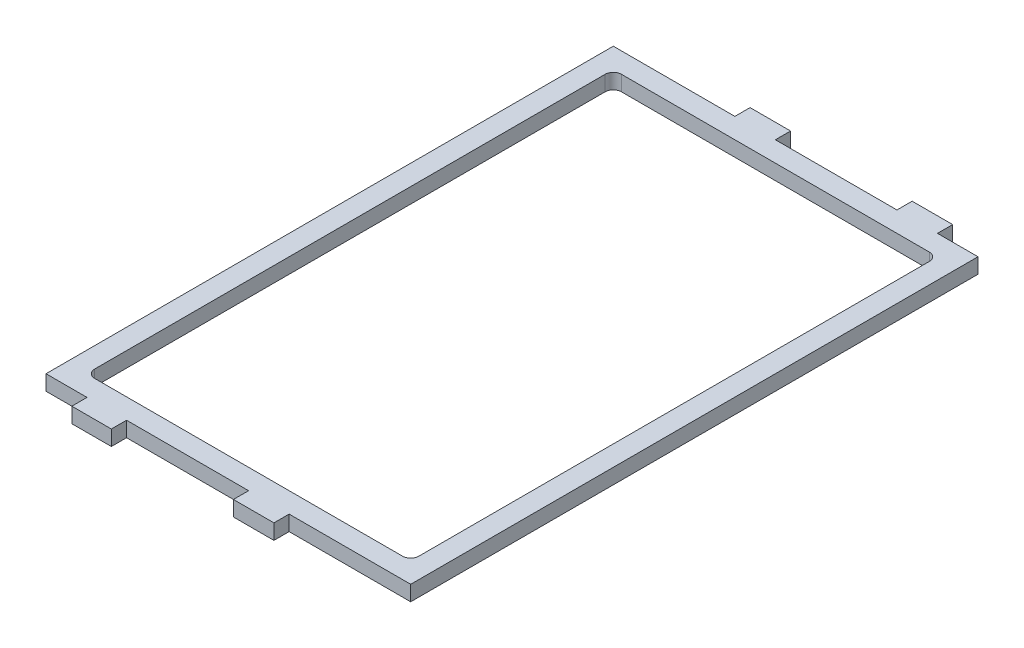
ISO-10303-21;
HEADER;
FILE_DESCRIPTION(('STEP AP214'),'2;1');
FILE_NAME('part.step','',(''),(''),'','','');
FILE_SCHEMA(('AUTOMOTIVE_DESIGN { 1 0 10303 214 1 1 1 1 }'));
ENDSEC;
DATA;
#1=APPLICATION_CONTEXT('core data for automotive mechanical design processes');
#2=APPLICATION_PROTOCOL_DEFINITION('international standard','automotive_design',2000,#1);
#3=PRODUCT_CONTEXT('',#1,'mechanical');
#4=PRODUCT('Part','Part','',(#3));
#5=PRODUCT_RELATED_PRODUCT_CATEGORY('part','',(#4));
#6=PRODUCT_DEFINITION_FORMATION('','',#4);
#7=PRODUCT_DEFINITION_CONTEXT('part definition',#1,'design');
#8=PRODUCT_DEFINITION('design','',#6,#7);
#9=PRODUCT_DEFINITION_SHAPE('','',#8);
#10=(LENGTH_UNIT() NAMED_UNIT(*) SI_UNIT(.MILLI.,.METRE.));
#11=(NAMED_UNIT(*) PLANE_ANGLE_UNIT() SI_UNIT($,.RADIAN.));
#12=(NAMED_UNIT(*) SI_UNIT($,.STERADIAN.) SOLID_ANGLE_UNIT());
#13=UNCERTAINTY_MEASURE_WITH_UNIT(LENGTH_MEASURE(1.E-05),#10,'distance_accuracy_value','');
#14=(GEOMETRIC_REPRESENTATION_CONTEXT(3) GLOBAL_UNCERTAINTY_ASSIGNED_CONTEXT((#13)) GLOBAL_UNIT_ASSIGNED_CONTEXT((#10,
#11,#12)) REPRESENTATION_CONTEXT('',''));
#15=CARTESIAN_POINT('',(0.,0.,0.));
#16=DIRECTION('',(0.,0.,1.));
#17=DIRECTION('',(1.,0.,0.));
#18=AXIS2_PLACEMENT_3D('',#15,#16,#17);
#19=CARTESIAN_POINT('',(57.15,4.7625,-88.9));
#20=DIRECTION('',(0.,0.,1.));
#21=DIRECTION('',(1.,0.,0.));
#22=AXIS2_PLACEMENT_3D('',#19,#20,#21);
#23=PLANE('',#22);
#24=DIRECTION('',(0.,-1.,0.));
#25=VECTOR('',#24,1.);
#26=CARTESIAN_POINT('',(-6.35000000000004,4.7625,-88.9));
#27=LINE('',#26,#25);
#28=CARTESIAN_POINT('',(-6.35000000000004,4.7625,-88.9));
#29=VERTEX_POINT('',#28);
#30=CARTESIAN_POINT('',(-6.35000000000004,0.,-88.9));
#31=VERTEX_POINT('',#30);
#32=EDGE_CURVE('E246',#29,#31,#27,.T.);
#33=ORIENTED_EDGE('',*,*,#32,.F.);
#34=DIRECTION('',(-1.,0.,0.));
#35=VECTOR('',#34,1.);
#36=CARTESIAN_POINT('',(57.15,4.7625,-88.9));
#37=LINE('',#36,#35);
#38=CARTESIAN_POINT('',(31.75,4.7625,-88.9));
#39=VERTEX_POINT('',#38);
#40=EDGE_CURVE('E335',#39,#29,#37,.T.);
#41=ORIENTED_EDGE('',*,*,#40,.F.);
#42=DIRECTION('',(0.,1.,0.));
#43=VECTOR('',#42,1.);
#44=CARTESIAN_POINT('',(31.75,4.7625,-88.9));
#45=LINE('',#44,#43);
#46=CARTESIAN_POINT('',(31.75,0.,-88.9));
#47=VERTEX_POINT('',#46);
#48=EDGE_CURVE('E250',#47,#39,#45,.T.);
#49=ORIENTED_EDGE('',*,*,#48,.F.);
#50=DIRECTION('',(-1.,0.,0.));
#51=VECTOR('',#50,1.);
#52=CARTESIAN_POINT('',(57.15,0.,-88.9));
#53=LINE('',#52,#51);
#54=EDGE_CURVE('E282',#47,#31,#53,.T.);
#55=ORIENTED_EDGE('',*,*,#54,.T.);
#56=EDGE_LOOP('',(#33,#41,#49,#55));
#57=FACE_BOUND('',#56,.T.);
#58=ADVANCED_FACE('F35',(#57),#23,.F.);
#59=DIRECTION('',(0.,1.,0.));
#60=VECTOR('',#59,1.);
#61=CARTESIAN_POINT('',(-19.05,4.7625,-88.9));
#62=LINE('',#61,#60);
#63=CARTESIAN_POINT('',(-19.05,0.,-88.9));
#64=VERTEX_POINT('',#63);
#65=CARTESIAN_POINT('',(-19.05,4.7625,-88.9));
#66=VERTEX_POINT('',#65);
#67=EDGE_CURVE('E243',#64,#66,#62,.T.);
#68=ORIENTED_EDGE('',*,*,#67,.F.);
#69=CARTESIAN_POINT('',(-57.15,0.,-88.9));
#70=VERTEX_POINT('',#69);
#71=EDGE_CURVE('E279',#64,#70,#53,.T.);
#72=ORIENTED_EDGE('',*,*,#71,.T.);
#73=DIRECTION('',(0.,-1.,0.));
#74=VECTOR('',#73,1.);
#75=CARTESIAN_POINT('',(-57.15,4.7625,-88.9));
#76=LINE('',#75,#74);
#77=CARTESIAN_POINT('',(-57.15,4.7625,-88.9));
#78=VERTEX_POINT('',#77);
#79=EDGE_CURVE('E291',#78,#70,#76,.T.);
#80=ORIENTED_EDGE('',*,*,#79,.F.);
#81=EDGE_CURVE('E284',#66,#78,#37,.T.);
#82=ORIENTED_EDGE('',*,*,#81,.F.);
#83=EDGE_LOOP('',(#68,#72,#80,#82));
#84=FACE_BOUND('',#83,.T.);
#85=ADVANCED_FACE('F544',(#84),#23,.F.);
#86=DIRECTION('',(0.,-1.,0.));
#87=VECTOR('',#86,1.);
#88=CARTESIAN_POINT('',(44.45,4.7625,-88.9));
#89=LINE('',#88,#87);
#90=CARTESIAN_POINT('',(44.45,4.7625,-88.9));
#91=VERTEX_POINT('',#90);
#92=CARTESIAN_POINT('',(44.45,0.,-88.9));
#93=VERTEX_POINT('',#92);
#94=EDGE_CURVE('E247',#91,#93,#89,.T.);
#95=ORIENTED_EDGE('',*,*,#94,.F.);
#96=CARTESIAN_POINT('',(57.15,4.7625,-88.9));
#97=VERTEX_POINT('',#96);
#98=EDGE_CURVE('E337',#97,#91,#37,.T.);
#99=ORIENTED_EDGE('',*,*,#98,.F.);
#100=DIRECTION('',(0.,-1.,0.));
#101=VECTOR('',#100,1.);
#102=CARTESIAN_POINT('',(57.15,4.7625,-88.9));
#103=LINE('',#102,#101);
#104=CARTESIAN_POINT('',(57.15,0.,-88.9));
#105=VERTEX_POINT('',#104);
#106=EDGE_CURVE('E343',#97,#105,#103,.T.);
#107=ORIENTED_EDGE('',*,*,#106,.T.);
#108=EDGE_CURVE('E298',#105,#93,#53,.T.);
#109=ORIENTED_EDGE('',*,*,#108,.T.);
#110=EDGE_LOOP('',(#95,#99,#107,#109));
#111=FACE_BOUND('',#110,.T.);
#112=ADVANCED_FACE('F362',(#111),#23,.F.);
#113=CARTESIAN_POINT('',(57.15,4.7625,88.9));
#114=DIRECTION('',(0.,0.,-1.));
#115=DIRECTION('',(-1.,0.,0.));
#116=AXIS2_PLACEMENT_3D('',#113,#114,#115);
#117=PLANE('',#116);
#118=DIRECTION('',(0.,-1.,0.));
#119=VECTOR('',#118,1.);
#120=CARTESIAN_POINT('',(6.35,4.7625,88.9));
#121=LINE('',#120,#119);
#122=CARTESIAN_POINT('',(6.35000000000001,4.7625,88.9));
#123=VERTEX_POINT('',#122);
#124=CARTESIAN_POINT('',(6.35000000000001,0.,88.9));
#125=VERTEX_POINT('',#124);
#126=EDGE_CURVE('E386',#123,#125,#121,.T.);
#127=ORIENTED_EDGE('',*,*,#126,.F.);
#128=DIRECTION('',(1.,0.,0.));
#129=VECTOR('',#128,1.);
#130=CARTESIAN_POINT('',(57.15,4.7625,88.9));
#131=LINE('',#130,#129);
#132=CARTESIAN_POINT('',(-31.9066109797348,4.7625,88.9));
#133=VERTEX_POINT('',#132);
#134=EDGE_CURVE('E304',#133,#123,#131,.T.);
#135=ORIENTED_EDGE('',*,*,#134,.F.);
#136=DIRECTION('',(0.,1.,0.));
#137=VECTOR('',#136,1.);
#138=CARTESIAN_POINT('',(-31.9066109797348,4.7625,88.9));
#139=LINE('',#138,#137);
#140=CARTESIAN_POINT('',(-31.9066109797348,0.,88.9));
#141=VERTEX_POINT('',#140);
#142=EDGE_CURVE('E415',#141,#133,#139,.T.);
#143=ORIENTED_EDGE('',*,*,#142,.F.);
#144=DIRECTION('',(1.,0.,0.));
#145=VECTOR('',#144,1.);
#146=CARTESIAN_POINT('',(57.15,0.,88.9));
#147=LINE('',#146,#145);
#148=EDGE_CURVE('E320',#141,#125,#147,.T.);
#149=ORIENTED_EDGE('',*,*,#148,.T.);
#150=EDGE_LOOP('',(#127,#135,#143,#149));
#151=FACE_BOUND('',#150,.T.);
#152=ADVANCED_FACE('F553',(#151),#117,.F.);
#153=DIRECTION('',(0.,1.,0.));
#154=VECTOR('',#153,1.);
#155=CARTESIAN_POINT('',(19.05,4.7625,88.9));
#156=LINE('',#155,#154);
#157=CARTESIAN_POINT('',(19.05,0.,88.9));
#158=VERTEX_POINT('',#157);
#159=CARTESIAN_POINT('',(19.05,4.7625,88.9));
#160=VERTEX_POINT('',#159);
#161=EDGE_CURVE('E388',#158,#160,#156,.T.);
#162=ORIENTED_EDGE('',*,*,#161,.F.);
#163=CARTESIAN_POINT('',(57.15,0.,88.9));
#164=VERTEX_POINT('',#163);
#165=EDGE_CURVE('E305',#158,#164,#147,.T.);
#166=ORIENTED_EDGE('',*,*,#165,.T.);
#167=DIRECTION('',(0.,-1.,0.));
#168=VECTOR('',#167,1.);
#169=CARTESIAN_POINT('',(57.15,4.7625,88.9));
#170=LINE('',#169,#168);
#171=CARTESIAN_POINT('',(57.15,4.7625,88.9));
#172=VERTEX_POINT('',#171);
#173=EDGE_CURVE('E361',#172,#164,#170,.T.);
#174=ORIENTED_EDGE('',*,*,#173,.F.);
#175=EDGE_CURVE('E301',#160,#172,#131,.T.);
#176=ORIENTED_EDGE('',*,*,#175,.F.);
#177=EDGE_LOOP('',(#162,#166,#174,#176));
#178=FACE_BOUND('',#177,.T.);
#179=ADVANCED_FACE('F557',(#178),#117,.F.);
#180=DIRECTION('',(0.,-1.,0.));
#181=VECTOR('',#180,1.);
#182=CARTESIAN_POINT('',(-44.2933890202652,4.7625,88.9));
#183=LINE('',#182,#181);
#184=CARTESIAN_POINT('',(-44.2933890202652,4.7625,88.9));
#185=VERTEX_POINT('',#184);
#186=CARTESIAN_POINT('',(-44.2933890202652,0.,88.9));
#187=VERTEX_POINT('',#186);
#188=EDGE_CURVE('E410',#185,#187,#183,.T.);
#189=ORIENTED_EDGE('',*,*,#188,.F.);
#190=CARTESIAN_POINT('',(-57.15,4.7625,88.9));
#191=VERTEX_POINT('',#190);
#192=EDGE_CURVE('E317',#191,#185,#131,.T.);
#193=ORIENTED_EDGE('',*,*,#192,.F.);
#194=DIRECTION('',(0.,-1.,0.));
#195=VECTOR('',#194,1.);
#196=CARTESIAN_POINT('',(-57.15,4.7625,88.9));
#197=LINE('',#196,#195);
#198=CARTESIAN_POINT('',(-57.15,0.,88.9));
#199=VERTEX_POINT('',#198);
#200=EDGE_CURVE('E498',#191,#199,#197,.T.);
#201=ORIENTED_EDGE('',*,*,#200,.T.);
#202=EDGE_CURVE('E322',#199,#187,#147,.T.);
#203=ORIENTED_EDGE('',*,*,#202,.T.);
#204=EDGE_LOOP('',(#189,#193,#201,#203));
#205=FACE_BOUND('',#204,.T.);
#206=ADVANCED_FACE('F560',(#205),#117,.F.);
#207=CARTESIAN_POINT('',(-57.15,4.7625,88.9));
#208=DIRECTION('',(0.,-1.,0.));
#209=DIRECTION('',(0.,0.,-1.));
#210=AXIS2_PLACEMENT_3D('',#207,#208,#209);
#211=PLANE('',#210);
#212=DIRECTION('',(0.,0.,1.));
#213=VECTOR('',#212,1.);
#214=CARTESIAN_POINT('',(-57.15,4.7625,-88.9));
#215=LINE('',#214,#213);
#216=EDGE_CURVE('E300',#78,#191,#215,.T.);
#217=ORIENTED_EDGE('',*,*,#216,.T.);
#218=ORIENTED_EDGE('',*,*,#192,.T.);
#219=DIRECTION('',(0.,0.,-1.));
#220=VECTOR('',#219,1.);
#221=CARTESIAN_POINT('',(-44.2933890202652,4.7625,93.6625));
#222=LINE('',#221,#220);
#223=CARTESIAN_POINT('',(-44.2933890202652,4.7625,93.6625));
#224=VERTEX_POINT('',#223);
#225=EDGE_CURVE('E421',#224,#185,#222,.T.);
#226=ORIENTED_EDGE('',*,*,#225,.F.);
#227=DIRECTION('',(-1.,0.,0.));
#228=VECTOR('',#227,1.);
#229=CARTESIAN_POINT('',(-31.9066109797348,4.7625,93.6625));
#230=LINE('',#229,#228);
#231=CARTESIAN_POINT('',(-31.9066109797348,4.7625,93.6625));
#232=VERTEX_POINT('',#231);
#233=EDGE_CURVE('E419',#232,#224,#230,.T.);
#234=ORIENTED_EDGE('',*,*,#233,.F.);
#235=DIRECTION('',(0.,0.,-1.));
#236=VECTOR('',#235,1.);
#237=CARTESIAN_POINT('',(-31.9066109797348,4.7625,93.6625));
#238=LINE('',#237,#236);
#239=EDGE_CURVE('E433',#232,#133,#238,.T.);
#240=ORIENTED_EDGE('',*,*,#239,.T.);
#241=ORIENTED_EDGE('',*,*,#134,.T.);
#242=DIRECTION('',(0.,0.,-1.));
#243=VECTOR('',#242,1.);
#244=CARTESIAN_POINT('',(6.35,4.7625,93.6625));
#245=LINE('',#244,#243);
#246=CARTESIAN_POINT('',(6.35,4.7625,93.6625));
#247=VERTEX_POINT('',#246);
#248=EDGE_CURVE('E400',#247,#123,#245,.T.);
#249=ORIENTED_EDGE('',*,*,#248,.F.);
#250=DIRECTION('',(-1.,0.,0.));
#251=VECTOR('',#250,1.);
#252=CARTESIAN_POINT('',(19.05,4.7625,93.6625));
#253=LINE('',#252,#251);
#254=CARTESIAN_POINT('',(19.05,4.7625,93.6625));
#255=VERTEX_POINT('',#254);
#256=EDGE_CURVE('E397',#255,#247,#253,.T.);
#257=ORIENTED_EDGE('',*,*,#256,.F.);
#258=DIRECTION('',(0.,0.,-1.));
#259=VECTOR('',#258,1.);
#260=CARTESIAN_POINT('',(19.05,4.7625,93.6625));
#261=LINE('',#260,#259);
#262=EDGE_CURVE('E402',#255,#160,#261,.T.);
#263=ORIENTED_EDGE('',*,*,#262,.T.);
#264=ORIENTED_EDGE('',*,*,#175,.T.);
#265=DIRECTION('',(0.,0.,-1.));
#266=VECTOR('',#265,1.);
#267=CARTESIAN_POINT('',(57.15,4.7625,-88.9));
#268=LINE('',#267,#266);
#269=EDGE_CURVE('E311',#172,#97,#268,.T.);
#270=ORIENTED_EDGE('',*,*,#269,.T.);
#271=ORIENTED_EDGE('',*,*,#98,.T.);
#272=DIRECTION('',(0.,0.,1.));
#273=VECTOR('',#272,1.);
#274=CARTESIAN_POINT('',(44.45,4.7625,-93.6625));
#275=LINE('',#274,#273);
#276=CARTESIAN_POINT('',(44.45,4.7625,-93.6625));
#277=VERTEX_POINT('',#276);
#278=EDGE_CURVE('E265',#277,#91,#275,.T.);
#279=ORIENTED_EDGE('',*,*,#278,.F.);
#280=DIRECTION('',(1.,0.,0.));
#281=VECTOR('',#280,1.);
#282=CARTESIAN_POINT('',(31.75,4.7625,-93.6625));
#283=LINE('',#282,#281);
#284=CARTESIAN_POINT('',(31.75,4.7625,-93.6625));
#285=VERTEX_POINT('',#284);
#286=EDGE_CURVE('E263',#285,#277,#283,.T.);
#287=ORIENTED_EDGE('',*,*,#286,.F.);
#288=DIRECTION('',(0.,0.,1.));
#289=VECTOR('',#288,1.);
#290=CARTESIAN_POINT('',(31.75,4.7625,-93.6625));
#291=LINE('',#290,#289);
#292=EDGE_CURVE('E276',#285,#39,#291,.T.);
#293=ORIENTED_EDGE('',*,*,#292,.T.);
#294=ORIENTED_EDGE('',*,*,#40,.T.);
#295=DIRECTION('',(0.,0.,1.));
#296=VECTOR('',#295,1.);
#297=CARTESIAN_POINT('',(-6.35000000000004,4.7625,-93.6625));
#298=LINE('',#297,#296);
#299=CARTESIAN_POINT('',(-6.35000000000004,4.7625,-93.6625));
#300=VERTEX_POINT('',#299);
#301=EDGE_CURVE('E837',#300,#29,#298,.T.);
#302=ORIENTED_EDGE('',*,*,#301,.F.);
#303=DIRECTION('',(1.,0.,0.));
#304=VECTOR('',#303,1.);
#305=CARTESIAN_POINT('',(-19.05,4.7625,-93.6625));
#306=LINE('',#305,#304);
#307=CARTESIAN_POINT('',(-19.05,4.7625,-93.6625));
#308=VERTEX_POINT('',#307);
#309=EDGE_CURVE('E239',#308,#300,#306,.T.);
#310=ORIENTED_EDGE('',*,*,#309,.F.);
#311=DIRECTION('',(0.,0.,1.));
#312=VECTOR('',#311,1.);
#313=CARTESIAN_POINT('',(-19.05,4.7625,-93.6625));
#314=LINE('',#313,#312);
#315=EDGE_CURVE('E252',#308,#66,#314,.T.);
#316=ORIENTED_EDGE('',*,*,#315,.T.);
#317=ORIENTED_EDGE('',*,*,#81,.T.);
#318=EDGE_LOOP('',(#217,#218,#226,#234,#240,#241,#249,#257,#263,#264,#270,#271,#279,#287,#293,
#294,#302,#310,#316,#317));
#319=FACE_BOUND('',#318,.T.);
#320=DIRECTION('',(0.,0.,-1.));
#321=VECTOR('',#320,1.);
#322=CARTESIAN_POINT('',(50.8,4.7625,-82.55));
#323=LINE('',#322,#321);
#324=CARTESIAN_POINT('',(50.8,4.7625,80.01));
#325=VERTEX_POINT('',#324);
#326=CARTESIAN_POINT('',(50.8,4.7625,-80.01));
#327=VERTEX_POINT('',#326);
#328=EDGE_CURVE('E467',#325,#327,#323,.T.);
#329=ORIENTED_EDGE('',*,*,#328,.F.);
#330=CARTESIAN_POINT('',(48.26,4.7625,80.01));
#331=DIRECTION('',(0.,-1.,0.));
#332=DIRECTION('',(0.,0.,-1.));
#333=AXIS2_PLACEMENT_3D('',#330,#331,#332);
#334=CIRCLE('',#333,2.54);
#335=CARTESIAN_POINT('',(48.26,4.7625,82.55));
#336=VERTEX_POINT('',#335);
#337=EDGE_CURVE('E492',#325,#336,#334,.T.);
#338=ORIENTED_EDGE('',*,*,#337,.T.);
#339=DIRECTION('',(1.,0.,0.));
#340=VECTOR('',#339,1.);
#341=CARTESIAN_POINT('',(50.8,4.7625,82.55));
#342=LINE('',#341,#340);
#343=CARTESIAN_POINT('',(-48.26,4.7625,82.55));
#344=VERTEX_POINT('',#343);
#345=EDGE_CURVE('E330',#344,#336,#342,.T.);
#346=ORIENTED_EDGE('',*,*,#345,.F.);
#347=CARTESIAN_POINT('',(-48.26,4.7625,80.0099999999999));
#348=DIRECTION('',(0.,-1.,0.));
#349=DIRECTION('',(0.,0.,-1.));
#350=AXIS2_PLACEMENT_3D('',#347,#348,#349);
#351=CIRCLE('',#350,2.54);
#352=CARTESIAN_POINT('',(-50.8,4.7625,80.0099999999999));
#353=VERTEX_POINT('',#352);
#354=EDGE_CURVE('E11',#344,#353,#351,.T.);
#355=ORIENTED_EDGE('',*,*,#354,.T.);
#356=DIRECTION('',(0.,0.,1.));
#357=VECTOR('',#356,1.);
#358=CARTESIAN_POINT('',(-50.8,4.7625,-82.55));
#359=LINE('',#358,#357);
#360=CARTESIAN_POINT('',(-50.8,4.7625,-80.01));
#361=VERTEX_POINT('',#360);
#362=EDGE_CURVE('E476',#361,#353,#359,.T.);
#363=ORIENTED_EDGE('',*,*,#362,.F.);
#364=CARTESIAN_POINT('',(-48.26,4.7625,-80.01));
#365=DIRECTION('',(0.,-1.,0.));
#366=DIRECTION('',(0.,0.,-1.));
#367=AXIS2_PLACEMENT_3D('',#364,#365,#366);
#368=CIRCLE('',#367,2.54);
#369=CARTESIAN_POINT('',(-48.26,4.7625,-82.55));
#370=VERTEX_POINT('',#369);
#371=EDGE_CURVE('E517',#361,#370,#368,.T.);
#372=ORIENTED_EDGE('',*,*,#371,.T.);
#373=DIRECTION('',(-1.,0.,0.));
#374=VECTOR('',#373,1.);
#375=CARTESIAN_POINT('',(50.8,4.7625,-82.55));
#376=LINE('',#375,#374);
#377=CARTESIAN_POINT('',(48.26,4.7625,-82.55));
#378=VERTEX_POINT('',#377);
#379=EDGE_CURVE('E470',#378,#370,#376,.T.);
#380=ORIENTED_EDGE('',*,*,#379,.F.);
#381=CARTESIAN_POINT('',(48.26,4.7625,-80.01));
#382=DIRECTION('',(0.,-1.,0.));
#383=DIRECTION('',(0.,0.,-1.));
#384=AXIS2_PLACEMENT_3D('',#381,#382,#383);
#385=CIRCLE('',#384,2.54);
#386=EDGE_CURVE('E513',#378,#327,#385,.T.);
#387=ORIENTED_EDGE('',*,*,#386,.T.);
#388=EDGE_LOOP('',(#329,#338,#346,#355,#363,#372,#380,#387));
#389=FACE_BOUND('',#388,.T.);
#390=ADVANCED_FACE('F351',(#319,#389),#211,.F.);
#391=CARTESIAN_POINT('',(-57.15,0.,88.9));
#392=DIRECTION('',(0.,-1.,0.));
#393=DIRECTION('',(0.,0.,-1.));
#394=AXIS2_PLACEMENT_3D('',#391,#392,#393);
#395=PLANE('',#394);
#396=DIRECTION('',(0.,0.,1.));
#397=VECTOR('',#396,1.);
#398=CARTESIAN_POINT('',(-57.15,0.,-88.9));
#399=LINE('',#398,#397);
#400=EDGE_CURVE('E326',#70,#199,#399,.T.);
#401=ORIENTED_EDGE('',*,*,#400,.F.);
#402=ORIENTED_EDGE('',*,*,#71,.F.);
#403=DIRECTION('',(0.,0.,1.));
#404=VECTOR('',#403,1.);
#405=CARTESIAN_POINT('',(-19.05,0.,-93.6625));
#406=LINE('',#405,#404);
#407=CARTESIAN_POINT('',(-19.05,0.,-93.6625));
#408=VERTEX_POINT('',#407);
#409=EDGE_CURVE('E230',#408,#64,#406,.T.);
#410=ORIENTED_EDGE('',*,*,#409,.F.);
#411=DIRECTION('',(-1.,0.,0.));
#412=VECTOR('',#411,1.);
#413=CARTESIAN_POINT('',(-19.05,0.,-93.6625));
#414=LINE('',#413,#412);
#415=CARTESIAN_POINT('',(-6.35000000000004,0.,-93.6625));
#416=VERTEX_POINT('',#415);
#417=EDGE_CURVE('E220',#416,#408,#414,.T.);
#418=ORIENTED_EDGE('',*,*,#417,.F.);
#419=DIRECTION('',(0.,0.,1.));
#420=VECTOR('',#419,1.);
#421=CARTESIAN_POINT('',(-6.35000000000004,0.,-93.6625));
#422=LINE('',#421,#420);
#423=EDGE_CURVE('E227',#416,#31,#422,.T.);
#424=ORIENTED_EDGE('',*,*,#423,.T.);
#425=ORIENTED_EDGE('',*,*,#54,.F.);
#426=DIRECTION('',(0.,0.,1.));
#427=VECTOR('',#426,1.);
#428=CARTESIAN_POINT('',(31.75,0.,-93.6625));
#429=LINE('',#428,#427);
#430=CARTESIAN_POINT('',(31.75,0.,-93.6625));
#431=VERTEX_POINT('',#430);
#432=EDGE_CURVE('E379',#431,#47,#429,.T.);
#433=ORIENTED_EDGE('',*,*,#432,.F.);
#434=DIRECTION('',(-1.,0.,0.));
#435=VECTOR('',#434,1.);
#436=CARTESIAN_POINT('',(31.75,0.,-93.6625));
#437=LINE('',#436,#435);
#438=CARTESIAN_POINT('',(44.45,0.,-93.6625));
#439=VERTEX_POINT('',#438);
#440=EDGE_CURVE('E259',#439,#431,#437,.T.);
#441=ORIENTED_EDGE('',*,*,#440,.F.);
#442=DIRECTION('',(0.,0.,1.));
#443=VECTOR('',#442,1.);
#444=CARTESIAN_POINT('',(44.45,0.,-93.6625));
#445=LINE('',#444,#443);
#446=EDGE_CURVE('E368',#439,#93,#445,.T.);
#447=ORIENTED_EDGE('',*,*,#446,.T.);
#448=ORIENTED_EDGE('',*,*,#108,.F.);
#449=DIRECTION('',(0.,0.,-1.));
#450=VECTOR('',#449,1.);
#451=CARTESIAN_POINT('',(57.15,0.,-88.9));
#452=LINE('',#451,#450);
#453=EDGE_CURVE('E283',#164,#105,#452,.T.);
#454=ORIENTED_EDGE('',*,*,#453,.F.);
#455=ORIENTED_EDGE('',*,*,#165,.F.);
#456=DIRECTION('',(0.,0.,-1.));
#457=VECTOR('',#456,1.);
#458=CARTESIAN_POINT('',(19.05,0.,93.6625));
#459=LINE('',#458,#457);
#460=CARTESIAN_POINT('',(19.05,0.,93.6625));
#461=VERTEX_POINT('',#460);
#462=EDGE_CURVE('E404',#461,#158,#459,.T.);
#463=ORIENTED_EDGE('',*,*,#462,.F.);
#464=DIRECTION('',(1.,0.,0.));
#465=VECTOR('',#464,1.);
#466=CARTESIAN_POINT('',(19.05,0.,93.6625));
#467=LINE('',#466,#465);
#468=CARTESIAN_POINT('',(6.35,0.,93.6625));
#469=VERTEX_POINT('',#468);
#470=EDGE_CURVE('E585',#469,#461,#467,.T.);
#471=ORIENTED_EDGE('',*,*,#470,.F.);
#472=DIRECTION('',(0.,0.,-1.));
#473=VECTOR('',#472,1.);
#474=CARTESIAN_POINT('',(6.35,0.,93.6625));
#475=LINE('',#474,#473);
#476=EDGE_CURVE('E407',#469,#125,#475,.T.);
#477=ORIENTED_EDGE('',*,*,#476,.T.);
#478=ORIENTED_EDGE('',*,*,#148,.F.);
#479=DIRECTION('',(0.,0.,-1.));
#480=VECTOR('',#479,1.);
#481=CARTESIAN_POINT('',(-31.9066109797348,0.,93.6625));
#482=LINE('',#481,#480);
#483=CARTESIAN_POINT('',(-31.9066109797348,0.,93.6625));
#484=VERTEX_POINT('',#483);
#485=EDGE_CURVE('E439',#484,#141,#482,.T.);
#486=ORIENTED_EDGE('',*,*,#485,.F.);
#487=DIRECTION('',(1.,0.,0.));
#488=VECTOR('',#487,1.);
#489=CARTESIAN_POINT('',(-31.9066109797348,0.,93.6625));
#490=LINE('',#489,#488);
#491=CARTESIAN_POINT('',(-44.2933890202652,0.,93.6625));
#492=VERTEX_POINT('',#491);
#493=EDGE_CURVE('E414',#492,#484,#490,.T.);
#494=ORIENTED_EDGE('',*,*,#493,.F.);
#495=DIRECTION('',(0.,0.,-1.));
#496=VECTOR('',#495,1.);
#497=CARTESIAN_POINT('',(-44.2933890202652,0.,93.6625));
#498=LINE('',#497,#496);
#499=EDGE_CURVE('E445',#492,#187,#498,.T.);
#500=ORIENTED_EDGE('',*,*,#499,.T.);
#501=ORIENTED_EDGE('',*,*,#202,.F.);
#502=EDGE_LOOP('',(#401,#402,#410,#418,#424,#425,#433,#441,#447,#448,#454,#455,#463,#471,#477,
#478,#486,#494,#500,#501));
#503=FACE_BOUND('',#502,.T.);
#504=DIRECTION('',(0.,0.,1.));
#505=VECTOR('',#504,1.);
#506=CARTESIAN_POINT('',(-50.8,0.,-82.55));
#507=LINE('',#506,#505);
#508=CARTESIAN_POINT('',(-50.8,0.,-80.01));
#509=VERTEX_POINT('',#508);
#510=CARTESIAN_POINT('',(-50.8,0.,80.0099999999999));
#511=VERTEX_POINT('',#510);
#512=EDGE_CURVE('E459',#509,#511,#507,.T.);
#513=ORIENTED_EDGE('',*,*,#512,.T.);
#514=CARTESIAN_POINT('',(-48.26,0.,80.0099999999999));
#515=DIRECTION('',(0.,-1.,0.));
#516=DIRECTION('',(0.,0.,-1.));
#517=AXIS2_PLACEMENT_3D('',#514,#515,#516);
#518=CIRCLE('',#517,2.54);
#519=CARTESIAN_POINT('',(-48.26,0.,82.55));
#520=VERTEX_POINT('',#519);
#521=EDGE_CURVE('E43',#511,#520,#518,.F.);
#522=ORIENTED_EDGE('',*,*,#521,.T.);
#523=DIRECTION('',(1.,0.,0.));
#524=VECTOR('',#523,1.);
#525=CARTESIAN_POINT('',(50.8,0.,82.55));
#526=LINE('',#525,#524);
#527=CARTESIAN_POINT('',(48.26,0.,82.55));
#528=VERTEX_POINT('',#527);
#529=EDGE_CURVE('E465',#520,#528,#526,.T.);
#530=ORIENTED_EDGE('',*,*,#529,.T.);
#531=CARTESIAN_POINT('',(48.26,0.,80.01));
#532=DIRECTION('',(0.,-1.,0.));
#533=DIRECTION('',(0.,0.,-1.));
#534=AXIS2_PLACEMENT_3D('',#531,#532,#533);
#535=CIRCLE('',#534,2.54);
#536=CARTESIAN_POINT('',(50.8,0.,80.01));
#537=VERTEX_POINT('',#536);
#538=EDGE_CURVE('E493',#528,#537,#535,.F.);
#539=ORIENTED_EDGE('',*,*,#538,.T.);
#540=DIRECTION('',(0.,0.,-1.));
#541=VECTOR('',#540,1.);
#542=CARTESIAN_POINT('',(50.8,0.,-82.55));
#543=LINE('',#542,#541);
#544=CARTESIAN_POINT('',(50.8,0.,-80.01));
#545=VERTEX_POINT('',#544);
#546=EDGE_CURVE('E452',#537,#545,#543,.T.);
#547=ORIENTED_EDGE('',*,*,#546,.T.);
#548=CARTESIAN_POINT('',(48.26,0.,-80.01));
#549=DIRECTION('',(0.,-1.,0.));
#550=DIRECTION('',(0.,0.,-1.));
#551=AXIS2_PLACEMENT_3D('',#548,#549,#550);
#552=CIRCLE('',#551,2.54);
#553=CARTESIAN_POINT('',(48.26,0.,-82.55));
#554=VERTEX_POINT('',#553);
#555=EDGE_CURVE('E511',#545,#554,#552,.F.);
#556=ORIENTED_EDGE('',*,*,#555,.T.);
#557=DIRECTION('',(-1.,0.,0.));
#558=VECTOR('',#557,1.);
#559=CARTESIAN_POINT('',(50.8,0.,-82.55));
#560=LINE('',#559,#558);
#561=CARTESIAN_POINT('',(-48.26,0.,-82.55));
#562=VERTEX_POINT('',#561);
#563=EDGE_CURVE('E455',#554,#562,#560,.T.);
#564=ORIENTED_EDGE('',*,*,#563,.T.);
#565=CARTESIAN_POINT('',(-48.26,0.,-80.01));
#566=DIRECTION('',(0.,-1.,0.));
#567=DIRECTION('',(0.,0.,-1.));
#568=AXIS2_PLACEMENT_3D('',#565,#566,#567);
#569=CIRCLE('',#568,2.54);
#570=EDGE_CURVE('E515',#562,#509,#569,.F.);
#571=ORIENTED_EDGE('',*,*,#570,.T.);
#572=EDGE_LOOP('',(#513,#522,#530,#539,#547,#556,#564,#571));
#573=FACE_BOUND('',#572,.T.);
#574=ADVANCED_FACE('F223',(#503,#573),#395,.T.);
#575=CARTESIAN_POINT('',(-57.15,4.7625,-88.9));
#576=DIRECTION('',(1.,0.,0.));
#577=DIRECTION('',(0.,0.,-1.));
#578=AXIS2_PLACEMENT_3D('',#575,#576,#577);
#579=PLANE('',#578);
#580=ORIENTED_EDGE('',*,*,#400,.T.);
#581=ORIENTED_EDGE('',*,*,#200,.F.);
#582=ORIENTED_EDGE('',*,*,#216,.F.);
#583=ORIENTED_EDGE('',*,*,#79,.T.);
#584=EDGE_LOOP('',(#580,#581,#582,#583));
#585=FACE_BOUND('',#584,.T.);
#586=ADVANCED_FACE('F540',(#585),#579,.F.);
#587=CARTESIAN_POINT('',(57.15,4.7625,-88.9));
#588=DIRECTION('',(-1.,0.,0.));
#589=DIRECTION('',(0.,0.,1.));
#590=AXIS2_PLACEMENT_3D('',#587,#588,#589);
#591=PLANE('',#590);
#592=ORIENTED_EDGE('',*,*,#453,.T.);
#593=ORIENTED_EDGE('',*,*,#106,.F.);
#594=ORIENTED_EDGE('',*,*,#269,.F.);
#595=ORIENTED_EDGE('',*,*,#173,.T.);
#596=EDGE_LOOP('',(#592,#593,#594,#595));
#597=FACE_BOUND('',#596,.T.);
#598=ADVANCED_FACE('F357',(#597),#591,.F.);
#599=CARTESIAN_POINT('',(50.8,4.7625,-82.55));
#600=DIRECTION('',(-1.,0.,0.));
#601=DIRECTION('',(0.,0.,1.));
#602=AXIS2_PLACEMENT_3D('',#599,#600,#601);
#603=PLANE('',#602);
#604=ORIENTED_EDGE('',*,*,#546,.F.);
#605=DIRECTION('',(0.,-1.,0.));
#606=VECTOR('',#605,1.);
#607=CARTESIAN_POINT('',(50.8,4.7625,80.01));
#608=LINE('',#607,#606);
#609=EDGE_CURVE('E496',#537,#325,#608,.F.);
#610=ORIENTED_EDGE('',*,*,#609,.T.);
#611=ORIENTED_EDGE('',*,*,#328,.T.);
#612=DIRECTION('',(0.,-1.,0.));
#613=VECTOR('',#612,1.);
#614=CARTESIAN_POINT('',(50.8,0.,-80.01));
#615=LINE('',#614,#613);
#616=EDGE_CURVE('E494',#327,#545,#615,.T.);
#617=ORIENTED_EDGE('',*,*,#616,.T.);
#618=EDGE_LOOP('',(#604,#610,#611,#617));
#619=FACE_BOUND('',#618,.T.);
#620=ADVANCED_FACE('F532',(#619),#603,.T.);
#621=CARTESIAN_POINT('',(50.8,4.7625,-82.55));
#622=DIRECTION('',(0.,0.,1.));
#623=DIRECTION('',(1.,0.,0.));
#624=AXIS2_PLACEMENT_3D('',#621,#622,#623);
#625=PLANE('',#624);
#626=ORIENTED_EDGE('',*,*,#563,.F.);
#627=DIRECTION('',(0.,-1.,0.));
#628=VECTOR('',#627,1.);
#629=CARTESIAN_POINT('',(48.26,4.7625,-82.55));
#630=LINE('',#629,#628);
#631=EDGE_CURVE('E504',#554,#378,#630,.F.);
#632=ORIENTED_EDGE('',*,*,#631,.T.);
#633=ORIENTED_EDGE('',*,*,#379,.T.);
#634=DIRECTION('',(0.,-1.,0.));
#635=VECTOR('',#634,1.);
#636=CARTESIAN_POINT('',(-48.26,0.,-82.55));
#637=LINE('',#636,#635);
#638=EDGE_CURVE('E501',#370,#562,#637,.T.);
#639=ORIENTED_EDGE('',*,*,#638,.T.);
#640=EDGE_LOOP('',(#626,#632,#633,#639));
#641=FACE_BOUND('',#640,.T.);
#642=ADVANCED_FACE('F528',(#641),#625,.T.);
#643=CARTESIAN_POINT('',(-50.8,4.7625,-82.55));
#644=DIRECTION('',(1.,0.,0.));
#645=DIRECTION('',(0.,0.,-1.));
#646=AXIS2_PLACEMENT_3D('',#643,#644,#645);
#647=PLANE('',#646);
#648=ORIENTED_EDGE('',*,*,#512,.F.);
#649=DIRECTION('',(0.,-1.,0.));
#650=VECTOR('',#649,1.);
#651=CARTESIAN_POINT('',(-50.8,4.7625,-80.01));
#652=LINE('',#651,#650);
#653=EDGE_CURVE('E55',#509,#361,#652,.F.);
#654=ORIENTED_EDGE('',*,*,#653,.T.);
#655=ORIENTED_EDGE('',*,*,#362,.T.);
#656=DIRECTION('',(0.,-1.,0.));
#657=VECTOR('',#656,1.);
#658=CARTESIAN_POINT('',(-50.8,0.,80.0099999999999));
#659=LINE('',#658,#657);
#660=EDGE_CURVE('E506',#353,#511,#659,.T.);
#661=ORIENTED_EDGE('',*,*,#660,.T.);
#662=EDGE_LOOP('',(#648,#654,#655,#661));
#663=FACE_BOUND('',#662,.T.);
#664=ADVANCED_FACE('F519',(#663),#647,.T.);
#665=CARTESIAN_POINT('',(50.8,4.7625,82.55));
#666=DIRECTION('',(0.,0.,-1.));
#667=DIRECTION('',(-1.,0.,0.));
#668=AXIS2_PLACEMENT_3D('',#665,#666,#667);
#669=PLANE('',#668);
#670=ORIENTED_EDGE('',*,*,#345,.T.);
#671=DIRECTION('',(0.,-1.,0.));
#672=VECTOR('',#671,1.);
#673=CARTESIAN_POINT('',(48.26,0.,82.55));
#674=LINE('',#673,#672);
#675=EDGE_CURVE('E485',#336,#528,#674,.T.);
#676=ORIENTED_EDGE('',*,*,#675,.T.);
#677=ORIENTED_EDGE('',*,*,#529,.F.);
#678=DIRECTION('',(0.,-1.,0.));
#679=VECTOR('',#678,1.);
#680=CARTESIAN_POINT('',(-48.26,4.7625,82.55));
#681=LINE('',#680,#679);
#682=EDGE_CURVE('E487',#520,#344,#681,.F.);
#683=ORIENTED_EDGE('',*,*,#682,.T.);
#684=EDGE_LOOP('',(#670,#676,#677,#683));
#685=FACE_BOUND('',#684,.T.);
#686=ADVANCED_FACE('F484',(#685),#669,.T.);
#687=CARTESIAN_POINT('',(-44.2933890202652,4.7625,93.6625));
#688=DIRECTION('',(1.,0.,0.));
#689=DIRECTION('',(0.,0.,-1.));
#690=AXIS2_PLACEMENT_3D('',#687,#688,#689);
#691=PLANE('',#690);
#692=ORIENTED_EDGE('',*,*,#188,.T.);
#693=ORIENTED_EDGE('',*,*,#499,.F.);
#694=DIRECTION('',(0.,-1.,0.));
#695=VECTOR('',#694,1.);
#696=CARTESIAN_POINT('',(-44.2933890202652,4.7625,93.6625));
#697=LINE('',#696,#695);
#698=EDGE_CURVE('E411',#224,#492,#697,.T.);
#699=ORIENTED_EDGE('',*,*,#698,.F.);
#700=ORIENTED_EDGE('',*,*,#225,.T.);
#701=EDGE_LOOP('',(#692,#693,#699,#700));
#702=FACE_BOUND('',#701,.T.);
#703=ADVANCED_FACE('F600',(#702),#691,.F.);
#704=CARTESIAN_POINT('',(-31.9066109797348,4.7625,93.6625));
#705=DIRECTION('',(-1.,0.,0.));
#706=DIRECTION('',(0.,0.,1.));
#707=AXIS2_PLACEMENT_3D('',#704,#705,#706);
#708=PLANE('',#707);
#709=ORIENTED_EDGE('',*,*,#142,.T.);
#710=ORIENTED_EDGE('',*,*,#239,.F.);
#711=DIRECTION('',(0.,1.,0.));
#712=VECTOR('',#711,1.);
#713=CARTESIAN_POINT('',(-31.9066109797348,4.7625,93.6625));
#714=LINE('',#713,#712);
#715=EDGE_CURVE('E417',#484,#232,#714,.T.);
#716=ORIENTED_EDGE('',*,*,#715,.F.);
#717=ORIENTED_EDGE('',*,*,#485,.T.);
#718=EDGE_LOOP('',(#709,#710,#716,#717));
#719=FACE_BOUND('',#718,.T.);
#720=ADVANCED_FACE('F597',(#719),#708,.F.);
#721=CARTESIAN_POINT('',(-44.2933890202652,0.,93.6625));
#722=DIRECTION('',(0.,0.,-1.));
#723=DIRECTION('',(-1.,0.,0.));
#724=AXIS2_PLACEMENT_3D('',#721,#722,#723);
#725=PLANE('',#724);
#726=ORIENTED_EDGE('',*,*,#698,.T.);
#727=ORIENTED_EDGE('',*,*,#493,.T.);
#728=ORIENTED_EDGE('',*,*,#715,.T.);
#729=ORIENTED_EDGE('',*,*,#233,.T.);
#730=EDGE_LOOP('',(#726,#727,#728,#729));
#731=FACE_BOUND('',#730,.T.);
#732=ADVANCED_FACE('F599',(#731),#725,.F.);
#733=CARTESIAN_POINT('',(6.35,4.7625,93.6625));
#734=DIRECTION('',(1.,0.,0.));
#735=DIRECTION('',(0.,0.,-1.));
#736=AXIS2_PLACEMENT_3D('',#733,#734,#735);
#737=PLANE('',#736);
#738=ORIENTED_EDGE('',*,*,#126,.T.);
#739=ORIENTED_EDGE('',*,*,#476,.F.);
#740=DIRECTION('',(0.,-1.,0.));
#741=VECTOR('',#740,1.);
#742=CARTESIAN_POINT('',(6.35,4.7625,93.6625));
#743=LINE('',#742,#741);
#744=EDGE_CURVE('E394',#247,#469,#743,.T.);
#745=ORIENTED_EDGE('',*,*,#744,.F.);
#746=ORIENTED_EDGE('',*,*,#248,.T.);
#747=EDGE_LOOP('',(#738,#739,#745,#746));
#748=FACE_BOUND('',#747,.T.);
#749=ADVANCED_FACE('F591',(#748),#737,.F.);
#750=CARTESIAN_POINT('',(19.05,4.7625,93.6625));
#751=DIRECTION('',(-1.,0.,0.));
#752=DIRECTION('',(0.,0.,1.));
#753=AXIS2_PLACEMENT_3D('',#750,#751,#752);
#754=PLANE('',#753);
#755=ORIENTED_EDGE('',*,*,#161,.T.);
#756=ORIENTED_EDGE('',*,*,#262,.F.);
#757=DIRECTION('',(0.,1.,0.));
#758=VECTOR('',#757,1.);
#759=CARTESIAN_POINT('',(19.05,4.7625,93.6625));
#760=LINE('',#759,#758);
#761=EDGE_CURVE('E582',#461,#255,#760,.T.);
#762=ORIENTED_EDGE('',*,*,#761,.F.);
#763=ORIENTED_EDGE('',*,*,#462,.T.);
#764=EDGE_LOOP('',(#755,#756,#762,#763));
#765=FACE_BOUND('',#764,.T.);
#766=ADVANCED_FACE('F581',(#765),#754,.F.);
#767=CARTESIAN_POINT('',(6.35,0.,93.6625));
#768=DIRECTION('',(0.,0.,-1.));
#769=DIRECTION('',(-1.,0.,0.));
#770=AXIS2_PLACEMENT_3D('',#767,#768,#769);
#771=PLANE('',#770);
#772=ORIENTED_EDGE('',*,*,#744,.T.);
#773=ORIENTED_EDGE('',*,*,#470,.T.);
#774=ORIENTED_EDGE('',*,*,#761,.T.);
#775=ORIENTED_EDGE('',*,*,#256,.T.);
#776=EDGE_LOOP('',(#772,#773,#774,#775));
#777=FACE_BOUND('',#776,.T.);
#778=ADVANCED_FACE('F589',(#777),#771,.F.);
#779=CARTESIAN_POINT('',(44.45,4.7625,-93.6625));
#780=DIRECTION('',(-1.,0.,0.));
#781=DIRECTION('',(0.,0.,1.));
#782=AXIS2_PLACEMENT_3D('',#779,#780,#781);
#783=PLANE('',#782);
#784=ORIENTED_EDGE('',*,*,#94,.T.);
#785=ORIENTED_EDGE('',*,*,#446,.F.);
#786=DIRECTION('',(0.,-1.,0.));
#787=VECTOR('',#786,1.);
#788=CARTESIAN_POINT('',(44.45,4.7625,-93.6625));
#789=LINE('',#788,#787);
#790=EDGE_CURVE('E256',#277,#439,#789,.T.);
#791=ORIENTED_EDGE('',*,*,#790,.F.);
#792=ORIENTED_EDGE('',*,*,#278,.T.);
#793=EDGE_LOOP('',(#784,#785,#791,#792));
#794=FACE_BOUND('',#793,.T.);
#795=ADVANCED_FACE('F366',(#794),#783,.F.);
#796=CARTESIAN_POINT('',(31.75,4.7625,-93.6625));
#797=DIRECTION('',(1.,0.,0.));
#798=DIRECTION('',(0.,1.,0.));
#799=AXIS2_PLACEMENT_3D('',#796,#797,#798);
#800=PLANE('',#799);
#801=ORIENTED_EDGE('',*,*,#48,.T.);
#802=ORIENTED_EDGE('',*,*,#292,.F.);
#803=DIRECTION('',(0.,1.,0.));
#804=VECTOR('',#803,1.);
#805=CARTESIAN_POINT('',(31.75,4.7625,-93.6625));
#806=LINE('',#805,#804);
#807=EDGE_CURVE('E261',#431,#285,#806,.T.);
#808=ORIENTED_EDGE('',*,*,#807,.F.);
#809=ORIENTED_EDGE('',*,*,#432,.T.);
#810=EDGE_LOOP('',(#801,#802,#808,#809));
#811=FACE_BOUND('',#810,.T.);
#812=ADVANCED_FACE('F378',(#811),#800,.F.);
#813=CARTESIAN_POINT('',(44.45,0.,-93.6625));
#814=DIRECTION('',(0.,0.,1.));
#815=DIRECTION('',(1.,0.,0.));
#816=AXIS2_PLACEMENT_3D('',#813,#814,#815);
#817=PLANE('',#816);
#818=ORIENTED_EDGE('',*,*,#790,.T.);
#819=ORIENTED_EDGE('',*,*,#440,.T.);
#820=ORIENTED_EDGE('',*,*,#807,.T.);
#821=ORIENTED_EDGE('',*,*,#286,.T.);
#822=EDGE_LOOP('',(#818,#819,#820,#821));
#823=FACE_BOUND('',#822,.T.);
#824=ADVANCED_FACE('F372',(#823),#817,.F.);
#825=CARTESIAN_POINT('',(-6.35000000000004,4.7625,-93.6625));
#826=DIRECTION('',(-1.,0.,0.));
#827=DIRECTION('',(0.,-1.,0.));
#828=AXIS2_PLACEMENT_3D('',#825,#826,#827);
#829=PLANE('',#828);
#830=ORIENTED_EDGE('',*,*,#32,.T.);
#831=ORIENTED_EDGE('',*,*,#423,.F.);
#832=DIRECTION('',(0.,-1.,0.));
#833=VECTOR('',#832,1.);
#834=CARTESIAN_POINT('',(-6.35000000000004,4.7625,-93.6625));
#835=LINE('',#834,#833);
#836=EDGE_CURVE('E234',#300,#416,#835,.T.);
#837=ORIENTED_EDGE('',*,*,#836,.F.);
#838=ORIENTED_EDGE('',*,*,#301,.T.);
#839=EDGE_LOOP('',(#830,#831,#837,#838));
#840=FACE_BOUND('',#839,.T.);
#841=ADVANCED_FACE('F245',(#840),#829,.F.);
#842=CARTESIAN_POINT('',(-19.05,4.7625,-93.6625));
#843=DIRECTION('',(1.,0.,0.));
#844=DIRECTION('',(0.,0.,-1.));
#845=AXIS2_PLACEMENT_3D('',#842,#843,#844);
#846=PLANE('',#845);
#847=ORIENTED_EDGE('',*,*,#67,.T.);
#848=ORIENTED_EDGE('',*,*,#315,.F.);
#849=DIRECTION('',(0.,1.,0.));
#850=VECTOR('',#849,1.);
#851=CARTESIAN_POINT('',(-19.05,4.7625,-93.6625));
#852=LINE('',#851,#850);
#853=EDGE_CURVE('E233',#408,#308,#852,.T.);
#854=ORIENTED_EDGE('',*,*,#853,.F.);
#855=ORIENTED_EDGE('',*,*,#409,.T.);
#856=EDGE_LOOP('',(#847,#848,#854,#855));
#857=FACE_BOUND('',#856,.T.);
#858=ADVANCED_FACE('F676',(#857),#846,.F.);
#859=CARTESIAN_POINT('',(-6.35000000000004,0.,-93.6625));
#860=DIRECTION('',(0.,0.,1.));
#861=DIRECTION('',(1.,0.,0.));
#862=AXIS2_PLACEMENT_3D('',#859,#860,#861);
#863=PLANE('',#862);
#864=ORIENTED_EDGE('',*,*,#836,.T.);
#865=ORIENTED_EDGE('',*,*,#417,.T.);
#866=ORIENTED_EDGE('',*,*,#853,.T.);
#867=ORIENTED_EDGE('',*,*,#309,.T.);
#868=EDGE_LOOP('',(#864,#865,#866,#867));
#869=FACE_BOUND('',#868,.T.);
#870=ADVANCED_FACE('F237',(#869),#863,.F.);
#871=CARTESIAN_POINT('',(48.26,4.7625,80.01));
#872=DIRECTION('',(0.,1.,0.));
#873=DIRECTION('',(0.,0.,1.));
#874=AXIS2_PLACEMENT_3D('',#871,#872,#873);
#875=CYLINDRICAL_SURFACE('',#874,2.54);
#876=ORIENTED_EDGE('',*,*,#337,.F.);
#877=ORIENTED_EDGE('',*,*,#609,.F.);
#878=ORIENTED_EDGE('',*,*,#538,.F.);
#879=ORIENTED_EDGE('',*,*,#675,.F.);
#880=EDGE_LOOP('',(#876,#877,#878,#879));
#881=FACE_BOUND('',#880,.T.);
#882=ADVANCED_FACE('F490',(#881),#875,.F.);
#883=CARTESIAN_POINT('',(48.26,4.7625,-80.01));
#884=DIRECTION('',(0.,1.,0.));
#885=DIRECTION('',(0.,0.,1.));
#886=AXIS2_PLACEMENT_3D('',#883,#884,#885);
#887=CYLINDRICAL_SURFACE('',#886,2.54);
#888=ORIENTED_EDGE('',*,*,#386,.F.);
#889=ORIENTED_EDGE('',*,*,#631,.F.);
#890=ORIENTED_EDGE('',*,*,#555,.F.);
#891=ORIENTED_EDGE('',*,*,#616,.F.);
#892=EDGE_LOOP('',(#888,#889,#890,#891));
#893=FACE_BOUND('',#892,.T.);
#894=ADVANCED_FACE('F531',(#893),#887,.F.);
#895=CARTESIAN_POINT('',(-48.26,4.7625,-80.01));
#896=DIRECTION('',(0.,1.,0.));
#897=DIRECTION('',(0.,0.,1.));
#898=AXIS2_PLACEMENT_3D('',#895,#896,#897);
#899=CYLINDRICAL_SURFACE('',#898,2.54);
#900=ORIENTED_EDGE('',*,*,#371,.F.);
#901=ORIENTED_EDGE('',*,*,#653,.F.);
#902=ORIENTED_EDGE('',*,*,#570,.F.);
#903=ORIENTED_EDGE('',*,*,#638,.F.);
#904=EDGE_LOOP('',(#900,#901,#902,#903));
#905=FACE_BOUND('',#904,.T.);
#906=ADVANCED_FACE('F522',(#905),#899,.F.);
#907=CARTESIAN_POINT('',(-48.26,4.7625,80.0099999999999));
#908=DIRECTION('',(0.,1.,0.));
#909=DIRECTION('',(0.,0.,1.));
#910=AXIS2_PLACEMENT_3D('',#907,#908,#909);
#911=CYLINDRICAL_SURFACE('',#910,2.54);
#912=ORIENTED_EDGE('',*,*,#354,.F.);
#913=ORIENTED_EDGE('',*,*,#682,.F.);
#914=ORIENTED_EDGE('',*,*,#521,.F.);
#915=ORIENTED_EDGE('',*,*,#660,.F.);
#916=EDGE_LOOP('',(#912,#913,#914,#915));
#917=FACE_BOUND('',#916,.T.);
#918=ADVANCED_FACE('F37',(#917),#911,.F.);
#919=CLOSED_SHELL('',(#58,#85,#112,#152,#179,#206,#390,#574,#586,#598,#620,#642,#664,#686,#703,
#720,#732,#749,#766,#778,#795,#812,#824,#841,#858,#870,#882,#894,#906,#918));
#920=MANIFOLD_SOLID_BREP('B2',#919);
#921=ADVANCED_BREP_SHAPE_REPRESENTATION('',(#18,#920),#14);
#922=SHAPE_DEFINITION_REPRESENTATION(#9,#921);
ENDSEC;
END-ISO-10303-21;
